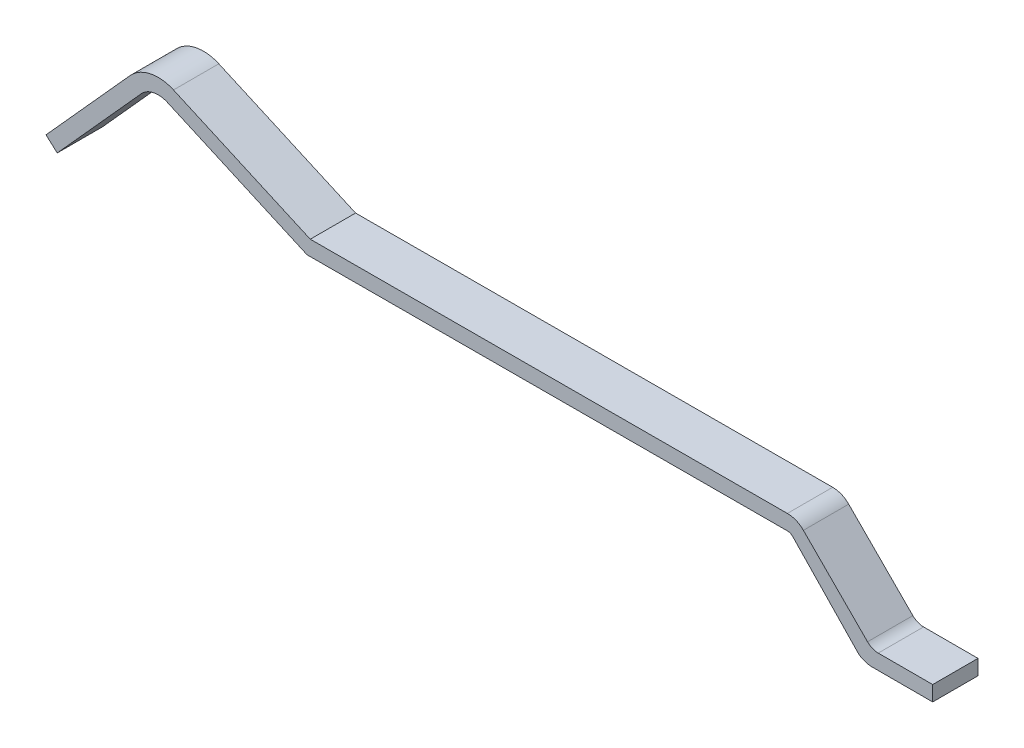
ISO-10303-21;
HEADER;
FILE_DESCRIPTION(('STEP AP214'),'2;1');
FILE_NAME('part.step','',(''),(''),'','','');
FILE_SCHEMA(('AUTOMOTIVE_DESIGN { 1 0 10303 214 1 1 1 1 }'));
ENDSEC;
DATA;
#1=APPLICATION_CONTEXT('core data for automotive mechanical design processes');
#2=APPLICATION_PROTOCOL_DEFINITION('international standard','automotive_design',2000,#1);
#3=PRODUCT_CONTEXT('',#1,'mechanical');
#4=PRODUCT('Part','Part','',(#3));
#5=PRODUCT_RELATED_PRODUCT_CATEGORY('part','',(#4));
#6=PRODUCT_DEFINITION_FORMATION('','',#4);
#7=PRODUCT_DEFINITION_CONTEXT('part definition',#1,'design');
#8=PRODUCT_DEFINITION('design','',#6,#7);
#9=PRODUCT_DEFINITION_SHAPE('','',#8);
#10=(LENGTH_UNIT() NAMED_UNIT(*) SI_UNIT(.MILLI.,.METRE.));
#11=(NAMED_UNIT(*) PLANE_ANGLE_UNIT() SI_UNIT($,.RADIAN.));
#12=(NAMED_UNIT(*) SI_UNIT($,.STERADIAN.) SOLID_ANGLE_UNIT());
#13=UNCERTAINTY_MEASURE_WITH_UNIT(LENGTH_MEASURE(1.E-05),#10,'distance_accuracy_value','');
#14=(GEOMETRIC_REPRESENTATION_CONTEXT(3) GLOBAL_UNCERTAINTY_ASSIGNED_CONTEXT((#13)) GLOBAL_UNIT_ASSIGNED_CONTEXT((#10,
#11,#12)) REPRESENTATION_CONTEXT('',''));
#15=CARTESIAN_POINT('',(0.,0.,0.));
#16=DIRECTION('',(0.,0.,1.));
#17=DIRECTION('',(1.,0.,0.));
#18=AXIS2_PLACEMENT_3D('',#15,#16,#17);
#19=CARTESIAN_POINT('',(19.9707476581065,0.204274436581358,0.3));
#20=DIRECTION('',(0.,-1.,0.));
#21=DIRECTION('',(1.,0.,0.));
#22=AXIS2_PLACEMENT_3D('',#19,#20,#21);
#23=PLANE('',#22);
#24=DIRECTION('',(0.,0.,-1.));
#25=VECTOR('',#24,1.);
#26=CARTESIAN_POINT('',(19.9707476581065,0.204274436581355,0.3));
#27=LINE('',#26,#25);
#28=CARTESIAN_POINT('',(19.9707476581065,0.204274436581354,-0.3));
#29=VERTEX_POINT('',#28);
#30=CARTESIAN_POINT('',(19.9707476581065,0.204274436581354,0.3));
#31=VERTEX_POINT('',#30);
#32=EDGE_CURVE('E232',#29,#31,#27,.F.);
#33=ORIENTED_EDGE('',*,*,#32,.T.);
#34=DIRECTION('',(-1.,0.,0.));
#35=VECTOR('',#34,1.);
#36=CARTESIAN_POINT('',(19.8917527563786,0.204274436581354,0.3));
#37=LINE('',#36,#35);
#38=CARTESIAN_POINT('',(20.6917527563786,0.204274436581356,0.3));
#39=VERTEX_POINT('',#38);
#40=EDGE_CURVE('E188',#31,#39,#37,.F.);
#41=ORIENTED_EDGE('',*,*,#40,.T.);
#42=DIRECTION('',(0.,0.,1.));
#43=VECTOR('',#42,1.);
#44=CARTESIAN_POINT('',(20.6917527563786,0.204274436581358,0.3));
#45=LINE('',#44,#43);
#46=CARTESIAN_POINT('',(20.6917527563786,0.204274436581355,-0.3));
#47=VERTEX_POINT('',#46);
#48=EDGE_CURVE('E276',#39,#47,#45,.F.);
#49=ORIENTED_EDGE('',*,*,#48,.T.);
#50=DIRECTION('',(-1.,0.,0.));
#51=VECTOR('',#50,1.);
#52=CARTESIAN_POINT('',(19.8917527563786,0.204274436581354,-0.3));
#53=LINE('',#52,#51);
#54=EDGE_CURVE('E271',#29,#47,#53,.F.);
#55=ORIENTED_EDGE('',*,*,#54,.F.);
#56=EDGE_LOOP('',(#33,#41,#49,#55));
#57=FACE_BOUND('',#56,.T.);
#58=ADVANCED_FACE('F17',(#57),#23,.F.);
#59=CARTESIAN_POINT('',(20.6917527563786,0.204274436581358,0.3));
#60=DIRECTION('',(-1.,0.,0.));
#61=DIRECTION('',(0.,0.,1.));
#62=AXIS2_PLACEMENT_3D('',#59,#60,#61);
#63=PLANE('',#62);
#64=ORIENTED_EDGE('',*,*,#48,.F.);
#65=DIRECTION('',(0.,1.,0.));
#66=VECTOR('',#65,1.);
#67=CARTESIAN_POINT('',(20.6917527563786,0.304274436581662,0.3));
#68=LINE('',#67,#66);
#69=CARTESIAN_POINT('',(20.6917527563786,0.00427443658130423,0.3));
#70=VERTEX_POINT('',#69);
#71=EDGE_CURVE('E226',#39,#70,#68,.F.);
#72=ORIENTED_EDGE('',*,*,#71,.T.);
#73=DIRECTION('',(0.,0.,1.));
#74=VECTOR('',#73,1.);
#75=CARTESIAN_POINT('',(20.6917527563786,0.00427443658130424,0.3));
#76=LINE('',#75,#74);
#77=CARTESIAN_POINT('',(20.6917527563786,0.00427443658130423,-0.3));
#78=VERTEX_POINT('',#77);
#79=EDGE_CURVE('E97',#70,#78,#76,.F.);
#80=ORIENTED_EDGE('',*,*,#79,.T.);
#81=DIRECTION('',(0.,1.,0.));
#82=VECTOR('',#81,1.);
#83=CARTESIAN_POINT('',(20.6917527563786,0.304274436581662,-0.3));
#84=LINE('',#83,#82);
#85=EDGE_CURVE('E279',#47,#78,#84,.F.);
#86=ORIENTED_EDGE('',*,*,#85,.F.);
#87=EDGE_LOOP('',(#64,#72,#80,#86));
#88=FACE_BOUND('',#87,.T.);
#89=ADVANCED_FACE('F343',(#88),#63,.F.);
#90=CARTESIAN_POINT('',(20.6917527563786,0.00427443658130424,0.3));
#91=DIRECTION('',(0.,1.,0.));
#92=DIRECTION('',(-1.,0.,0.));
#93=AXIS2_PLACEMENT_3D('',#90,#91,#92);
#94=PLANE('',#93);
#95=ORIENTED_EDGE('',*,*,#79,.F.);
#96=DIRECTION('',(-1.,0.,0.));
#97=VECTOR('',#96,1.);
#98=CARTESIAN_POINT('',(19.8917527563786,0.00427443658130422,0.3));
#99=LINE('',#98,#97);
#100=CARTESIAN_POINT('',(19.8917527563786,0.00427443658130357,0.3));
#101=VERTEX_POINT('',#100);
#102=EDGE_CURVE('E224',#70,#101,#99,.T.);
#103=ORIENTED_EDGE('',*,*,#102,.T.);
#104=DIRECTION('',(0.,0.,-1.));
#105=VECTOR('',#104,1.);
#106=CARTESIAN_POINT('',(19.8917527563786,0.00427443658130292,0.3));
#107=LINE('',#106,#105);
#108=CARTESIAN_POINT('',(19.8917527563786,0.00427443658130357,-0.3));
#109=VERTEX_POINT('',#108);
#110=EDGE_CURVE('E87',#109,#101,#107,.F.);
#111=ORIENTED_EDGE('',*,*,#110,.F.);
#112=DIRECTION('',(-1.,0.,0.));
#113=VECTOR('',#112,1.);
#114=CARTESIAN_POINT('',(19.8917527563786,0.00427443658130422,-0.3));
#115=LINE('',#114,#113);
#116=EDGE_CURVE('E282',#78,#109,#115,.T.);
#117=ORIENTED_EDGE('',*,*,#116,.F.);
#118=EDGE_LOOP('',(#95,#103,#111,#117));
#119=FACE_BOUND('',#118,.T.);
#120=ADVANCED_FACE('F344',(#119),#94,.F.);
#121=CARTESIAN_POINT('',(19.8917527563786,0.304274436581662,0.3));
#122=DIRECTION('',(0.,0.,-1.));
#123=DIRECTION('',(-1.,0.,0.));
#124=AXIS2_PLACEMENT_3D('',#121,#122,#123);
#125=CYLINDRICAL_SURFACE('',#124,0.300000000000359);
#126=CARTESIAN_POINT('',(19.8917527563786,0.304274436581662,0.3));
#127=DIRECTION('',(0.,0.,-1.));
#128=DIRECTION('',(-1.,0.,0.));
#129=AXIS2_PLACEMENT_3D('',#126,#127,#128);
#130=CIRCLE('',#129,0.300000000000359);
#131=CARTESIAN_POINT('',(19.7117527563786,0.0642744365812117,0.3));
#132=VERTEX_POINT('',#131);
#133=EDGE_CURVE('E20',#101,#132,#130,.T.);
#134=ORIENTED_EDGE('',*,*,#133,.T.);
#135=DIRECTION('',(0.,0.,1.));
#136=VECTOR('',#135,1.);
#137=CARTESIAN_POINT('',(19.7117527563786,0.0642744365812143,0.3));
#138=LINE('',#137,#136);
#139=CARTESIAN_POINT('',(19.7117527563786,0.0642744365812117,-0.3));
#140=VERTEX_POINT('',#139);
#141=EDGE_CURVE('E160',#132,#140,#138,.F.);
#142=ORIENTED_EDGE('',*,*,#141,.T.);
#143=CARTESIAN_POINT('',(19.8917527563786,0.304274436581662,-0.3));
#144=DIRECTION('',(0.,0.,-1.));
#145=DIRECTION('',(-1.,0.,0.));
#146=AXIS2_PLACEMENT_3D('',#143,#144,#145);
#147=CIRCLE('',#146,0.300000000000359);
#148=EDGE_CURVE('E306',#109,#140,#147,.T.);
#149=ORIENTED_EDGE('',*,*,#148,.F.);
#150=ORIENTED_EDGE('',*,*,#110,.T.);
#151=EDGE_LOOP('',(#134,#142,#149,#150));
#152=FACE_BOUND('',#151,.T.);
#153=ADVANCED_FACE('F346',(#152),#125,.T.);
#154=CARTESIAN_POINT('',(19.7117527563786,0.0642744365812144,0.3));
#155=DIRECTION('',(0.721713092096621,0.692192323488447,0.));
#156=DIRECTION('',(-0.692192323488447,0.721713092096621,0.));
#157=AXIS2_PLACEMENT_3D('',#154,#155,#156);
#158=PLANE('',#157);
#159=ORIENTED_EDGE('',*,*,#141,.F.);
#160=DIRECTION('',(-0.692192323488447,0.72171309209662,0.));
#161=VECTOR('',#160,1.);
#162=CARTESIAN_POINT('',(19.7117527563786,0.0642744365812143,0.3));
#163=LINE('',#162,#161);
#164=CARTESIAN_POINT('',(18.838199365785,0.975083321978061,0.3));
#165=VERTEX_POINT('',#164);
#166=EDGE_CURVE('E172',#132,#165,#163,.T.);
#167=ORIENTED_EDGE('',*,*,#166,.T.);
#168=DIRECTION('',(0.,0.,-1.));
#169=VECTOR('',#168,1.);
#170=CARTESIAN_POINT('',(18.8381993657854,0.9750833219777,0.3));
#171=LINE('',#170,#169);
#172=CARTESIAN_POINT('',(18.838199365785,0.975083321978061,-0.3));
#173=VERTEX_POINT('',#172);
#174=EDGE_CURVE('E268',#165,#173,#171,.T.);
#175=ORIENTED_EDGE('',*,*,#174,.T.);
#176=DIRECTION('',(-0.692192323488447,0.72171309209662,0.));
#177=VECTOR('',#176,1.);
#178=CARTESIAN_POINT('',(19.7117527563786,0.0642744365812143,-0.3));
#179=LINE('',#178,#177);
#180=EDGE_CURVE('E305',#140,#173,#179,.T.);
#181=ORIENTED_EDGE('',*,*,#180,.F.);
#182=EDGE_LOOP('',(#159,#167,#175,#181));
#183=FACE_BOUND('',#182,.T.);
#184=ADVANCED_FACE('F349',(#183),#158,.F.);
#185=CARTESIAN_POINT('',(12.407488687666,0.99,0.3));
#186=DIRECTION('',(0.40673664307565,0.913545457642668,0.));
#187=DIRECTION('',(-0.913545457642668,0.40673664307565,0.));
#188=AXIS2_PLACEMENT_3D('',#185,#186,#187);
#189=PLANE('',#188);
#190=DIRECTION('',(0.,0.,1.));
#191=VECTOR('',#190,1.);
#192=CARTESIAN_POINT('',(12.407488687666,0.99,0.3));
#193=LINE('',#192,#191);
#194=CARTESIAN_POINT('',(12.407488687666,0.99,0.3));
#195=VERTEX_POINT('',#194);
#196=CARTESIAN_POINT('',(12.407488687666,0.99,-0.3));
#197=VERTEX_POINT('',#196);
#198=EDGE_CURVE('E151',#195,#197,#193,.F.);
#199=ORIENTED_EDGE('',*,*,#198,.F.);
#200=DIRECTION('',(-0.913545457642668,0.40673664307565,0.));
#201=VECTOR('',#200,1.);
#202=CARTESIAN_POINT('',(12.407488687666,0.99,0.3));
#203=LINE('',#202,#201);
#204=CARTESIAN_POINT('',(10.5579715524435,1.81345808257036,0.3));
#205=VERTEX_POINT('',#204);
#206=EDGE_CURVE('E155',#195,#205,#203,.T.);
#207=ORIENTED_EDGE('',*,*,#206,.T.);
#208=DIRECTION('',(0.,0.,-1.));
#209=VECTOR('',#208,1.);
#210=CARTESIAN_POINT('',(10.5579715524435,1.81345808257035,0.3));
#211=LINE('',#210,#209);
#212=CARTESIAN_POINT('',(10.5579715524435,1.81345808257036,-0.3));
#213=VERTEX_POINT('',#212);
#214=EDGE_CURVE('E159',#205,#213,#211,.T.);
#215=ORIENTED_EDGE('',*,*,#214,.T.);
#216=DIRECTION('',(-0.913545457642668,0.40673664307565,0.));
#217=VECTOR('',#216,1.);
#218=CARTESIAN_POINT('',(12.407488687666,0.99,-0.3));
#219=LINE('',#218,#217);
#220=EDGE_CURVE('E156',#197,#213,#219,.T.);
#221=ORIENTED_EDGE('',*,*,#220,.F.);
#222=EDGE_LOOP('',(#199,#207,#215,#221));
#223=FACE_BOUND('',#222,.T.);
#224=ADVANCED_FACE('F153',(#223),#189,.F.);
#225=CARTESIAN_POINT('',(10.4359505595208,1.53939444527741,0.3));
#226=DIRECTION('',(0.,0.,-1.));
#227=DIRECTION('',(-1.,0.,0.));
#228=AXIS2_PLACEMENT_3D('',#225,#226,#227);
#229=CYLINDRICAL_SURFACE('',#228,0.300000000000163);
#230=ORIENTED_EDGE('',*,*,#214,.F.);
#231=CARTESIAN_POINT('',(10.4359505595208,1.53939444527741,0.3));
#232=DIRECTION('',(0.,0.,-1.));
#233=DIRECTION('',(-1.,0.,0.));
#234=AXIS2_PLACEMENT_3D('',#231,#232,#233);
#235=CIRCLE('',#234,0.300000000000163);
#236=CARTESIAN_POINT('',(10.2130071118774,1.74013362718514,0.3));
#237=VERTEX_POINT('',#236);
#238=EDGE_CURVE('E171',#205,#237,#235,.F.);
#239=ORIENTED_EDGE('',*,*,#238,.T.);
#240=DIRECTION('',(0.,0.,1.));
#241=VECTOR('',#240,1.);
#242=CARTESIAN_POINT('',(10.2130071118774,1.74013362718514,0.3));
#243=LINE('',#242,#241);
#244=CARTESIAN_POINT('',(10.2130071118774,1.74013362718514,-0.3));
#245=VERTEX_POINT('',#244);
#246=EDGE_CURVE('E261',#237,#245,#243,.F.);
#247=ORIENTED_EDGE('',*,*,#246,.T.);
#248=CARTESIAN_POINT('',(10.4359505595208,1.53939444527741,-0.3));
#249=DIRECTION('',(0.,0.,-1.));
#250=DIRECTION('',(-1.,0.,0.));
#251=AXIS2_PLACEMENT_3D('',#248,#249,#250);
#252=CIRCLE('',#251,0.300000000000163);
#253=EDGE_CURVE('E134',#213,#245,#252,.F.);
#254=ORIENTED_EDGE('',*,*,#253,.F.);
#255=EDGE_LOOP('',(#230,#239,#247,#254));
#256=FACE_BOUND('',#255,.T.);
#257=ADVANCED_FACE('F315',(#256),#229,.F.);
#258=CARTESIAN_POINT('',(10.2130071118774,1.74013362718514,0.3));
#259=DIRECTION('',(-0.743144825477495,0.669130606358746,0.));
#260=DIRECTION('',(-0.669130606358746,-0.743144825477495,0.));
#261=AXIS2_PLACEMENT_3D('',#258,#259,#260);
#262=PLANE('',#261);
#263=ORIENTED_EDGE('',*,*,#246,.F.);
#264=DIRECTION('',(-0.669130606358745,-0.743144825477496,0.));
#265=VECTOR('',#264,1.);
#266=CARTESIAN_POINT('',(10.2130071118774,1.74013362718514,0.3));
#267=LINE('',#266,#265);
#268=CARTESIAN_POINT('',(9.09953182556442,0.503494039252559,0.3));
#269=VERTEX_POINT('',#268);
#270=EDGE_CURVE('E216',#237,#269,#267,.T.);
#271=ORIENTED_EDGE('',*,*,#270,.T.);
#272=DIRECTION('',(0.,0.,1.));
#273=VECTOR('',#272,1.);
#274=CARTESIAN_POINT('',(9.09953182556442,0.50349403925256,0.3));
#275=LINE('',#274,#273);
#276=CARTESIAN_POINT('',(9.09953182556442,0.503494039252559,-0.3));
#277=VERTEX_POINT('',#276);
#278=EDGE_CURVE('E252',#269,#277,#275,.F.);
#279=ORIENTED_EDGE('',*,*,#278,.T.);
#280=DIRECTION('',(-0.669130606358745,-0.743144825477496,0.));
#281=VECTOR('',#280,1.);
#282=CARTESIAN_POINT('',(10.2130071118774,1.74013362718514,-0.3));
#283=LINE('',#282,#281);
#284=EDGE_CURVE('E139',#245,#277,#283,.T.);
#285=ORIENTED_EDGE('',*,*,#284,.F.);
#286=EDGE_LOOP('',(#263,#271,#279,#285));
#287=FACE_BOUND('',#286,.T.);
#288=ADVANCED_FACE('F317',(#287),#262,.F.);
#289=CARTESIAN_POINT('',(9.09953182556442,0.50349403925256,0.3));
#290=DIRECTION('',(0.669130606358746,0.743144825477495,0.));
#291=DIRECTION('',(-0.743144825477495,0.669130606358746,0.));
#292=AXIS2_PLACEMENT_3D('',#289,#290,#291);
#293=PLANE('',#292);
#294=ORIENTED_EDGE('',*,*,#278,.F.);
#295=DIRECTION('',(-0.743144825477496,0.669130606358746,0.));
#296=VECTOR('',#295,1.);
#297=CARTESIAN_POINT('',(9.09953182556442,0.50349403925256,0.3));
#298=LINE('',#297,#296);
#299=CARTESIAN_POINT('',(8.95090286046869,0.63732016052452,0.3));
#300=VERTEX_POINT('',#299);
#301=EDGE_CURVE('E213',#269,#300,#298,.T.);
#302=ORIENTED_EDGE('',*,*,#301,.T.);
#303=DIRECTION('',(0.,0.,1.));
#304=VECTOR('',#303,1.);
#305=CARTESIAN_POINT('',(8.95090286046869,0.63732016052452,0.3));
#306=LINE('',#305,#304);
#307=CARTESIAN_POINT('',(8.95090286046869,0.63732016052452,-0.3));
#308=VERTEX_POINT('',#307);
#309=EDGE_CURVE('E249',#300,#308,#306,.F.);
#310=ORIENTED_EDGE('',*,*,#309,.T.);
#311=DIRECTION('',(-0.743144825477496,0.669130606358746,0.));
#312=VECTOR('',#311,1.);
#313=CARTESIAN_POINT('',(9.09953182556442,0.50349403925256,-0.3));
#314=LINE('',#313,#312);
#315=EDGE_CURVE('E255',#277,#308,#314,.T.);
#316=ORIENTED_EDGE('',*,*,#315,.F.);
#317=EDGE_LOOP('',(#294,#302,#310,#316));
#318=FACE_BOUND('',#317,.T.);
#319=ADVANCED_FACE('F387',(#318),#293,.F.);
#320=CARTESIAN_POINT('',(8.95090286046869,0.63732016052452,0.3));
#321=DIRECTION('',(0.743144825477361,-0.669130606358895,0.));
#322=DIRECTION('',(0.669130606358895,0.743144825477361,0.));
#323=AXIS2_PLACEMENT_3D('',#320,#321,#322);
#324=PLANE('',#323);
#325=ORIENTED_EDGE('',*,*,#309,.F.);
#326=DIRECTION('',(0.669130606358895,0.743144825477361,0.));
#327=VECTOR('',#326,1.);
#328=CARTESIAN_POINT('',(8.95090286046869,0.63732016052452,0.3));
#329=LINE('',#328,#327);
#330=CARTESIAN_POINT('',(10.064378146782,1.87395974845693,0.3));
#331=VERTEX_POINT('',#330);
#332=EDGE_CURVE('E210',#300,#331,#329,.T.);
#333=ORIENTED_EDGE('',*,*,#332,.T.);
#334=DIRECTION('',(0.,0.,-1.));
#335=VECTOR('',#334,1.);
#336=CARTESIAN_POINT('',(10.0643781467819,1.87395974845692,0.3));
#337=LINE('',#336,#335);
#338=CARTESIAN_POINT('',(10.064378146782,1.87395974845693,-0.3));
#339=VERTEX_POINT('',#338);
#340=EDGE_CURVE('E247',#339,#331,#337,.F.);
#341=ORIENTED_EDGE('',*,*,#340,.F.);
#342=DIRECTION('',(0.669130606358895,0.743144825477361,0.));
#343=VECTOR('',#342,1.);
#344=CARTESIAN_POINT('',(8.95090286046869,0.63732016052452,-0.3));
#345=LINE('',#344,#343);
#346=EDGE_CURVE('E257',#308,#339,#345,.T.);
#347=ORIENTED_EDGE('',*,*,#346,.F.);
#348=EDGE_LOOP('',(#325,#333,#341,#347));
#349=FACE_BOUND('',#348,.T.);
#350=ADVANCED_FACE('F384',(#349),#324,.F.);
#351=CARTESIAN_POINT('',(10.4359505595208,1.53939444527736,0.3));
#352=DIRECTION('',(0.,0.,-1.));
#353=DIRECTION('',(-1.,0.,0.));
#354=AXIS2_PLACEMENT_3D('',#351,#352,#353);
#355=CYLINDRICAL_SURFACE('',#354,0.50000000000019);
#356=CARTESIAN_POINT('',(10.4359505595208,1.53939444527736,0.3));
#357=DIRECTION('',(0.,0.,-1.));
#358=DIRECTION('',(-1.,0.,0.));
#359=AXIS2_PLACEMENT_3D('',#356,#357,#358);
#360=CIRCLE('',#359,0.50000000000019);
#361=CARTESIAN_POINT('',(10.6393188810587,1.99616717409889,0.3));
#362=VERTEX_POINT('',#361);
#363=EDGE_CURVE('E207',#331,#362,#360,.T.);
#364=ORIENTED_EDGE('',*,*,#363,.T.);
#365=DIRECTION('',(0.,0.,1.));
#366=VECTOR('',#365,1.);
#367=CARTESIAN_POINT('',(10.6393188810586,1.9961671740989,0.3));
#368=LINE('',#367,#366);
#369=CARTESIAN_POINT('',(10.6393188810587,1.99616717409889,-0.3));
#370=VERTEX_POINT('',#369);
#371=EDGE_CURVE('E242',#362,#370,#368,.F.);
#372=ORIENTED_EDGE('',*,*,#371,.T.);
#373=CARTESIAN_POINT('',(10.4359505595208,1.53939444527736,-0.3));
#374=DIRECTION('',(0.,0.,-1.));
#375=DIRECTION('',(-1.,0.,0.));
#376=AXIS2_PLACEMENT_3D('',#373,#374,#375);
#377=CIRCLE('',#376,0.50000000000019);
#378=EDGE_CURVE('E300',#339,#370,#377,.T.);
#379=ORIENTED_EDGE('',*,*,#378,.F.);
#380=ORIENTED_EDGE('',*,*,#340,.T.);
#381=EDGE_LOOP('',(#364,#372,#379,#380));
#382=FACE_BOUND('',#381,.T.);
#383=ADVANCED_FACE('F378',(#382),#355,.T.);
#384=CARTESIAN_POINT('',(10.6393188810586,1.9961671740989,0.3));
#385=DIRECTION('',(-0.40673664307565,-0.913545457642668,0.));
#386=DIRECTION('',(0.913545457642668,-0.40673664307565,0.));
#387=AXIS2_PLACEMENT_3D('',#384,#385,#386);
#388=PLANE('',#387);
#389=ORIENTED_EDGE('',*,*,#371,.F.);
#390=DIRECTION('',(0.913545457642668,-0.40673664307565,0.));
#391=VECTOR('',#390,1.);
#392=CARTESIAN_POINT('',(10.6393188810586,1.9961671740989,0.3));
#393=LINE('',#392,#391);
#394=CARTESIAN_POINT('',(12.4499999999999,1.19000000000004,0.3));
#395=VERTEX_POINT('',#394);
#396=EDGE_CURVE('E202',#362,#395,#393,.T.);
#397=ORIENTED_EDGE('',*,*,#396,.T.);
#398=DIRECTION('',(0.,0.,1.));
#399=VECTOR('',#398,1.);
#400=CARTESIAN_POINT('',(12.4499999999999,1.19000000000005,0.3));
#401=LINE('',#400,#399);
#402=CARTESIAN_POINT('',(12.4499999999999,1.19000000000004,-0.3));
#403=VERTEX_POINT('',#402);
#404=EDGE_CURVE('E239',#395,#403,#401,.F.);
#405=ORIENTED_EDGE('',*,*,#404,.T.);
#406=DIRECTION('',(0.913545457642668,-0.40673664307565,0.));
#407=VECTOR('',#406,1.);
#408=CARTESIAN_POINT('',(10.6393188810586,1.9961671740989,-0.3));
#409=LINE('',#408,#407);
#410=EDGE_CURVE('E302',#370,#403,#409,.T.);
#411=ORIENTED_EDGE('',*,*,#410,.F.);
#412=EDGE_LOOP('',(#389,#397,#405,#411));
#413=FACE_BOUND('',#412,.T.);
#414=ADVANCED_FACE('F373',(#413),#388,.F.);
#415=CARTESIAN_POINT('',(12.4499999999999,1.19000000000005,0.3));
#416=DIRECTION('',(0.00225950545360753,-0.999997447314295,0.));
#417=DIRECTION('',(0.999997447314294,0.00225950545360753,0.));
#418=AXIS2_PLACEMENT_3D('',#415,#416,#417);
#419=PLANE('',#418);
#420=ORIENTED_EDGE('',*,*,#404,.F.);
#421=DIRECTION('',(0.999997447314294,0.00225950545360753,0.));
#422=VECTOR('',#421,1.);
#423=CARTESIAN_POINT('',(12.4499999999999,1.19000000000005,0.3));
#424=LINE('',#423,#422);
#425=CARTESIAN_POINT('',(18.7674886876667,1.20427443658107,0.3));
#426=VERTEX_POINT('',#425);
#427=EDGE_CURVE('E199',#395,#426,#424,.T.);
#428=ORIENTED_EDGE('',*,*,#427,.T.);
#429=DIRECTION('',(0.,0.,-1.));
#430=VECTOR('',#429,1.);
#431=CARTESIAN_POINT('',(18.7674886876667,1.20427443658106,0.3));
#432=LINE('',#431,#430);
#433=CARTESIAN_POINT('',(18.7674886876667,1.20427443658107,-0.3));
#434=VERTEX_POINT('',#433);
#435=EDGE_CURVE('E237',#434,#426,#432,.F.);
#436=ORIENTED_EDGE('',*,*,#435,.F.);
#437=DIRECTION('',(0.999997447314294,0.00225950545360753,0.));
#438=VECTOR('',#437,1.);
#439=CARTESIAN_POINT('',(12.4499999999999,1.19000000000005,-0.3));
#440=LINE('',#439,#438);
#441=EDGE_CURVE('E299',#403,#434,#440,.T.);
#442=ORIENTED_EDGE('',*,*,#441,.F.);
#443=EDGE_LOOP('',(#420,#428,#436,#442));
#444=FACE_BOUND('',#443,.T.);
#445=ADVANCED_FACE('F368',(#444),#419,.F.);
#446=CARTESIAN_POINT('',(18.768162863443,0.905902040883409,0.3));
#447=DIRECTION('',(0.,0.,-1.));
#448=DIRECTION('',(-1.,0.,0.));
#449=AXIS2_PLACEMENT_3D('',#446,#447,#448);
#450=CYLINDRICAL_SURFACE('',#449,0.298373157350547);
#451=CARTESIAN_POINT('',(18.768162863443,0.905902040883409,0.3));
#452=DIRECTION('',(0.,0.,-1.));
#453=DIRECTION('',(-1.,0.,0.));
#454=AXIS2_PLACEMENT_3D('',#451,#452,#453);
#455=CIRCLE('',#454,0.298373157350547);
#456=CARTESIAN_POINT('',(18.9796207220227,1.11640647093701,0.3));
#457=VERTEX_POINT('',#456);
#458=EDGE_CURVE('E198',#426,#457,#455,.T.);
#459=ORIENTED_EDGE('',*,*,#458,.T.);
#460=DIRECTION('',(0.,0.,1.));
#461=VECTOR('',#460,1.);
#462=CARTESIAN_POINT('',(18.9796207220227,1.11640647093704,0.3));
#463=LINE('',#462,#461);
#464=CARTESIAN_POINT('',(18.9796207220227,1.11640647093701,-0.3));
#465=VERTEX_POINT('',#464);
#466=EDGE_CURVE('E234',#457,#465,#463,.F.);
#467=ORIENTED_EDGE('',*,*,#466,.T.);
#468=CARTESIAN_POINT('',(18.768162863443,0.905902040883409,-0.3));
#469=DIRECTION('',(0.,0.,-1.));
#470=DIRECTION('',(-1.,0.,0.));
#471=AXIS2_PLACEMENT_3D('',#468,#469,#470);
#472=CIRCLE('',#471,0.298373157350547);
#473=EDGE_CURVE('E297',#434,#465,#472,.T.);
#474=ORIENTED_EDGE('',*,*,#473,.F.);
#475=ORIENTED_EDGE('',*,*,#435,.T.);
#476=EDGE_LOOP('',(#459,#467,#474,#475));
#477=FACE_BOUND('',#476,.T.);
#478=ADVANCED_FACE('F362',(#477),#450,.T.);
#479=CARTESIAN_POINT('',(18.9796207220227,1.11640647093704,0.3));
#480=DIRECTION('',(-0.708702687793605,-0.705507264536744,0.));
#481=DIRECTION('',(0.705507264536744,-0.708702687793605,0.));
#482=AXIS2_PLACEMENT_3D('',#479,#480,#481);
#483=PLANE('',#482);
#484=ORIENTED_EDGE('',*,*,#466,.F.);
#485=DIRECTION('',(0.705507264536733,-0.708702687793617,0.));
#486=VECTOR('',#485,1.);
#487=CARTESIAN_POINT('',(18.9796207220227,1.11640647093706,0.3));
#488=LINE('',#487,#486);
#489=CARTESIAN_POINT('',(19.8290071205478,0.263172983674004,0.3));
#490=VERTEX_POINT('',#489);
#491=EDGE_CURVE('E195',#457,#490,#488,.T.);
#492=ORIENTED_EDGE('',*,*,#491,.T.);
#493=DIRECTION('',(0.,0.,-1.));
#494=VECTOR('',#493,1.);
#495=CARTESIAN_POINT('',(19.8290071205478,0.263172983674004,0.3));
#496=LINE('',#495,#494);
#497=CARTESIAN_POINT('',(19.8290071205478,0.263172983674004,-0.3));
#498=VERTEX_POINT('',#497);
#499=EDGE_CURVE('E229',#490,#498,#496,.T.);
#500=ORIENTED_EDGE('',*,*,#499,.T.);
#501=DIRECTION('',(0.705507264536733,-0.708702687793617,0.));
#502=VECTOR('',#501,1.);
#503=CARTESIAN_POINT('',(18.9796207220227,1.11640647093706,-0.3));
#504=LINE('',#503,#502);
#505=EDGE_CURVE('E181',#465,#498,#504,.T.);
#506=ORIENTED_EDGE('',*,*,#505,.F.);
#507=EDGE_LOOP('',(#484,#492,#500,#506));
#508=FACE_BOUND('',#507,.T.);
#509=ADVANCED_FACE('F358',(#508),#483,.F.);
#510=CARTESIAN_POINT('',(19.9707476581065,0.40427443658135,0.3));
#511=DIRECTION('',(0.,0.,-1.));
#512=DIRECTION('',(-1.,0.,0.));
#513=AXIS2_PLACEMENT_3D('',#510,#511,#512);
#514=CYLINDRICAL_SURFACE('',#513,0.199999999999995);
#515=ORIENTED_EDGE('',*,*,#499,.F.);
#516=CARTESIAN_POINT('',(19.9707476581065,0.40427443658135,0.3));
#517=DIRECTION('',(0.,0.,-1.));
#518=DIRECTION('',(-1.,0.,0.));
#519=AXIS2_PLACEMENT_3D('',#516,#517,#518);
#520=CIRCLE('',#519,0.199999999999995);
#521=EDGE_CURVE('E192',#490,#31,#520,.F.);
#522=ORIENTED_EDGE('',*,*,#521,.T.);
#523=ORIENTED_EDGE('',*,*,#32,.F.);
#524=CARTESIAN_POINT('',(19.9707476581065,0.40427443658135,-0.3));
#525=DIRECTION('',(0.,0.,-1.));
#526=DIRECTION('',(-1.,0.,0.));
#527=AXIS2_PLACEMENT_3D('',#524,#525,#526);
#528=CIRCLE('',#527,0.199999999999995);
#529=EDGE_CURVE('E177',#498,#29,#528,.F.);
#530=ORIENTED_EDGE('',*,*,#529,.F.);
#531=EDGE_LOOP('',(#515,#522,#523,#530));
#532=FACE_BOUND('',#531,.T.);
#533=ADVANCED_FACE('F355',(#532),#514,.F.);
#534=CARTESIAN_POINT('',(19.8917527563786,0.304274436581662,0.3));
#535=DIRECTION('',(0.,0.,-1.));
#536=DIRECTION('',(-1.,0.,0.));
#537=AXIS2_PLACEMENT_3D('',#534,#535,#536);
#538=PLANE('',#537);
#539=ORIENTED_EDGE('',*,*,#521,.F.);
#540=ORIENTED_EDGE('',*,*,#491,.F.);
#541=ORIENTED_EDGE('',*,*,#458,.F.);
#542=ORIENTED_EDGE('',*,*,#427,.F.);
#543=ORIENTED_EDGE('',*,*,#396,.F.);
#544=ORIENTED_EDGE('',*,*,#363,.F.);
#545=ORIENTED_EDGE('',*,*,#332,.F.);
#546=ORIENTED_EDGE('',*,*,#301,.F.);
#547=ORIENTED_EDGE('',*,*,#270,.F.);
#548=ORIENTED_EDGE('',*,*,#238,.F.);
#549=ORIENTED_EDGE('',*,*,#206,.F.);
#550=DIRECTION('',(-0.999997447314294,-0.00225950545360761,0.));
#551=VECTOR('',#550,1.);
#552=CARTESIAN_POINT('',(18.767488687666,1.00437049136829,0.3));
#553=LINE('',#552,#551);
#554=CARTESIAN_POINT('',(18.767488687666,1.00437049136829,0.3));
#555=VERTEX_POINT('',#554);
#556=EDGE_CURVE('E168',#195,#555,#553,.F.);
#557=ORIENTED_EDGE('',*,*,#556,.T.);
#558=CARTESIAN_POINT('',(18.7677134245142,0.904907896956171,0.3));
#559=DIRECTION('',(0.,0.,-1.));
#560=DIRECTION('',(-1.,0.,0.));
#561=AXIS2_PLACEMENT_3D('',#558,#559,#560);
#562=CIRCLE('',#561,0.0994628483094902);
#563=EDGE_CURVE('E191',#555,#165,#562,.T.);
#564=ORIENTED_EDGE('',*,*,#563,.T.);
#565=ORIENTED_EDGE('',*,*,#166,.F.);
#566=ORIENTED_EDGE('',*,*,#133,.F.);
#567=ORIENTED_EDGE('',*,*,#102,.F.);
#568=ORIENTED_EDGE('',*,*,#71,.F.);
#569=ORIENTED_EDGE('',*,*,#40,.F.);
#570=EDGE_LOOP('',(#539,#540,#541,#542,#543,#544,#545,#546,#547,#548,#549,#557,#564,#565,#566,
#567,#568,#569));
#571=FACE_BOUND('',#570,.T.);
#572=ADVANCED_FACE('F166',(#571),#538,.F.);
#573=CARTESIAN_POINT('',(18.7677134245142,0.904907896956171,0.3));
#574=DIRECTION('',(0.,0.,-1.));
#575=DIRECTION('',(-1.,0.,0.));
#576=AXIS2_PLACEMENT_3D('',#573,#574,#575);
#577=CYLINDRICAL_SURFACE('',#576,0.0994628483094902);
#578=ORIENTED_EDGE('',*,*,#174,.F.);
#579=ORIENTED_EDGE('',*,*,#563,.F.);
#580=DIRECTION('',(0.,0.,1.));
#581=VECTOR('',#580,1.);
#582=CARTESIAN_POINT('',(18.767488687666,1.00437049136829,0.3));
#583=LINE('',#582,#581);
#584=CARTESIAN_POINT('',(18.767488687666,1.00437049136829,-0.3));
#585=VERTEX_POINT('',#584);
#586=EDGE_CURVE('E26',#555,#585,#583,.F.);
#587=ORIENTED_EDGE('',*,*,#586,.T.);
#588=CARTESIAN_POINT('',(18.7677134245142,0.904907896956171,-0.3));
#589=DIRECTION('',(0.,0.,-1.));
#590=DIRECTION('',(-1.,0.,0.));
#591=AXIS2_PLACEMENT_3D('',#588,#589,#590);
#592=CIRCLE('',#591,0.0994628483094902);
#593=EDGE_CURVE('E34',#173,#585,#592,.F.);
#594=ORIENTED_EDGE('',*,*,#593,.F.);
#595=EDGE_LOOP('',(#578,#579,#587,#594));
#596=FACE_BOUND('',#595,.T.);
#597=ADVANCED_FACE('F352',(#596),#577,.F.);
#598=CARTESIAN_POINT('',(19.8917527563786,0.304274436581662,-0.3));
#599=DIRECTION('',(0.,0.,-1.));
#600=DIRECTION('',(-1.,0.,0.));
#601=AXIS2_PLACEMENT_3D('',#598,#599,#600);
#602=PLANE('',#601);
#603=ORIENTED_EDGE('',*,*,#505,.T.);
#604=ORIENTED_EDGE('',*,*,#529,.T.);
#605=ORIENTED_EDGE('',*,*,#54,.T.);
#606=ORIENTED_EDGE('',*,*,#85,.T.);
#607=ORIENTED_EDGE('',*,*,#116,.T.);
#608=ORIENTED_EDGE('',*,*,#148,.T.);
#609=ORIENTED_EDGE('',*,*,#180,.T.);
#610=ORIENTED_EDGE('',*,*,#593,.T.);
#611=DIRECTION('',(-0.999997447314294,-0.00225950545360761,0.));
#612=VECTOR('',#611,1.);
#613=CARTESIAN_POINT('',(18.767488687666,1.00437049136829,-0.3));
#614=LINE('',#613,#612);
#615=EDGE_CURVE('E11',#585,#197,#614,.T.);
#616=ORIENTED_EDGE('',*,*,#615,.T.);
#617=ORIENTED_EDGE('',*,*,#220,.T.);
#618=ORIENTED_EDGE('',*,*,#253,.T.);
#619=ORIENTED_EDGE('',*,*,#284,.T.);
#620=ORIENTED_EDGE('',*,*,#315,.T.);
#621=ORIENTED_EDGE('',*,*,#346,.T.);
#622=ORIENTED_EDGE('',*,*,#378,.T.);
#623=ORIENTED_EDGE('',*,*,#410,.T.);
#624=ORIENTED_EDGE('',*,*,#441,.T.);
#625=ORIENTED_EDGE('',*,*,#473,.T.);
#626=EDGE_LOOP('',(#603,#604,#605,#606,#607,#608,#609,#610,#616,#617,#618,#619,#620,#621,#622,
#623,#624,#625));
#627=FACE_BOUND('',#626,.T.);
#628=ADVANCED_FACE('F336',(#627),#602,.T.);
#629=CARTESIAN_POINT('',(18.767488687666,1.00437049136829,0.3));
#630=DIRECTION('',(-0.00225950545360761,0.999997447314295,0.));
#631=DIRECTION('',(-0.999997447314294,-0.00225950545360761,0.));
#632=AXIS2_PLACEMENT_3D('',#629,#630,#631);
#633=PLANE('',#632);
#634=ORIENTED_EDGE('',*,*,#586,.F.);
#635=ORIENTED_EDGE('',*,*,#556,.F.);
#636=ORIENTED_EDGE('',*,*,#198,.T.);
#637=ORIENTED_EDGE('',*,*,#615,.F.);
#638=EDGE_LOOP('',(#634,#635,#636,#637));
#639=FACE_BOUND('',#638,.T.);
#640=ADVANCED_FACE('F175',(#639),#633,.F.);
#641=CLOSED_SHELL('',(#58,#89,#120,#153,#184,#224,#257,#288,#319,#350,#383,#414,#445,#478,#509,
#533,#572,#597,#628,#640));
#642=MANIFOLD_SOLID_BREP('B1',#641);
#643=ADVANCED_BREP_SHAPE_REPRESENTATION('',(#18,#642),#14);
#644=SHAPE_DEFINITION_REPRESENTATION(#9,#643);
ENDSEC;
END-ISO-10303-21;
